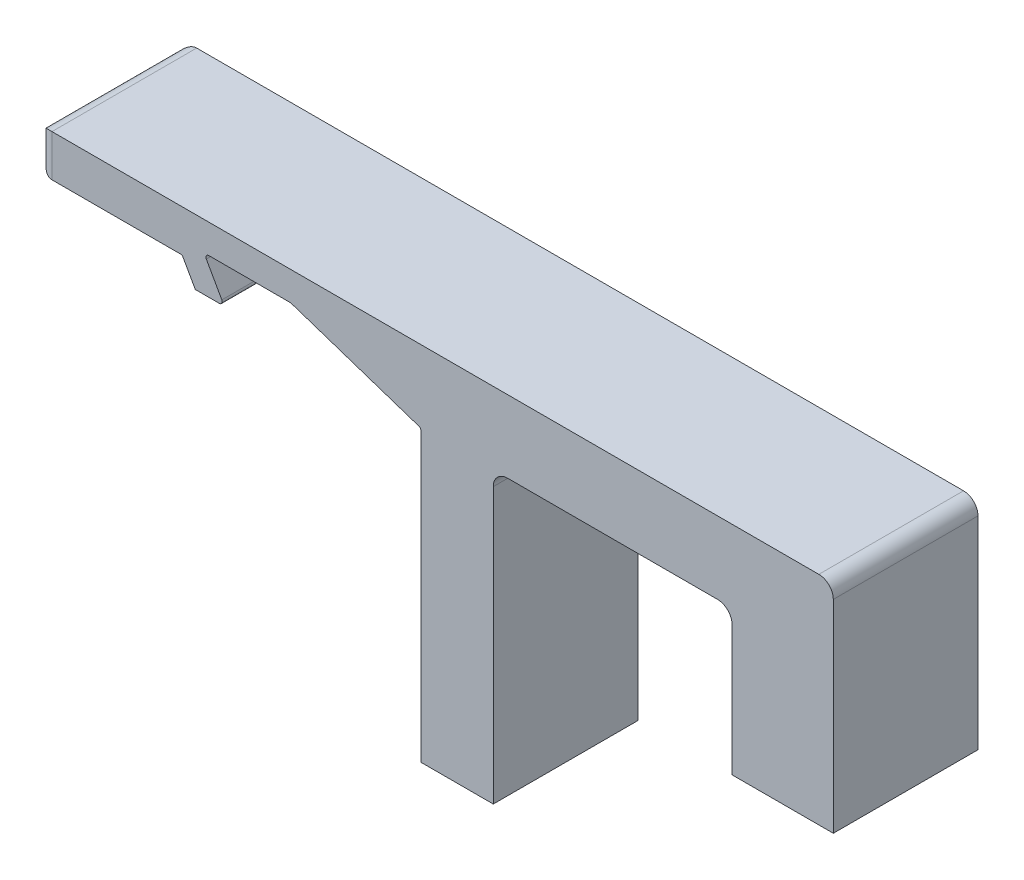
ISO-10303-21;
HEADER;
FILE_DESCRIPTION(('STEP AP214'),'2;1');
FILE_NAME('part.step','',(''),(''),'','','');
FILE_SCHEMA(('AUTOMOTIVE_DESIGN { 1 0 10303 214 1 1 1 1 }'));
ENDSEC;
DATA;
#1=APPLICATION_CONTEXT('core data for automotive mechanical design processes');
#2=APPLICATION_PROTOCOL_DEFINITION('international standard','automotive_design',2000,#1);
#3=PRODUCT_CONTEXT('',#1,'mechanical');
#4=PRODUCT('Part','Part','',(#3));
#5=PRODUCT_RELATED_PRODUCT_CATEGORY('part','',(#4));
#6=PRODUCT_DEFINITION_FORMATION('','',#4);
#7=PRODUCT_DEFINITION_CONTEXT('part definition',#1,'design');
#8=PRODUCT_DEFINITION('design','',#6,#7);
#9=PRODUCT_DEFINITION_SHAPE('','',#8);
#10=(LENGTH_UNIT() NAMED_UNIT(*) SI_UNIT(.MILLI.,.METRE.));
#11=(NAMED_UNIT(*) PLANE_ANGLE_UNIT() SI_UNIT($,.RADIAN.));
#12=(NAMED_UNIT(*) SI_UNIT($,.STERADIAN.) SOLID_ANGLE_UNIT());
#13=UNCERTAINTY_MEASURE_WITH_UNIT(LENGTH_MEASURE(1.E-05),#10,'distance_accuracy_value','');
#14=(GEOMETRIC_REPRESENTATION_CONTEXT(3) GLOBAL_UNCERTAINTY_ASSIGNED_CONTEXT((#13)) GLOBAL_UNIT_ASSIGNED_CONTEXT((#10,
#11,#12)) REPRESENTATION_CONTEXT('',''));
#15=CARTESIAN_POINT('',(0.,0.,0.));
#16=DIRECTION('',(0.,0.,1.));
#17=DIRECTION('',(1.,0.,0.));
#18=AXIS2_PLACEMENT_3D('',#15,#16,#17);
#19=CARTESIAN_POINT('',(0.,2.99999999999999,10.));
#20=DIRECTION('',(0.,1.,0.));
#21=DIRECTION('',(0.,0.,1.));
#22=AXIS2_PLACEMENT_3D('',#19,#20,#21);
#23=PLANE('',#22);
#24=DIRECTION('',(1.,0.,0.));
#25=VECTOR('',#24,1.);
#26=CARTESIAN_POINT('',(0.,2.99999999999999,0.));
#27=LINE('',#26,#25);
#28=CARTESIAN_POINT('',(-36.15795299471,2.99999999999999,0.));
#29=VERTEX_POINT('',#28);
#30=CARTESIAN_POINT('',(-30.5324555320337,2.99999999999999,0.));
#31=VERTEX_POINT('',#30);
#32=EDGE_CURVE('E288',#29,#31,#27,.T.);
#33=ORIENTED_EDGE('',*,*,#32,.T.);
#34=DIRECTION('',(0.,0.,-1.));
#35=VECTOR('',#34,1.);
#36=CARTESIAN_POINT('',(-30.5324555320337,2.99999999999999,10.));
#37=LINE('',#36,#35);
#38=CARTESIAN_POINT('',(-30.5324555320337,2.99999999999999,10.));
#39=VERTEX_POINT('',#38);
#40=EDGE_CURVE('E362',#31,#39,#37,.F.);
#41=ORIENTED_EDGE('',*,*,#40,.T.);
#42=DIRECTION('',(1.,0.,0.));
#43=VECTOR('',#42,1.);
#44=CARTESIAN_POINT('',(0.,2.99999999999999,10.));
#45=LINE('',#44,#43);
#46=CARTESIAN_POINT('',(-36.15795299471,2.99999999999999,10.));
#47=VERTEX_POINT('',#46);
#48=EDGE_CURVE('E336',#47,#39,#45,.T.);
#49=ORIENTED_EDGE('',*,*,#48,.F.);
#50=DIRECTION('',(0.,0.,-1.));
#51=VECTOR('',#50,1.);
#52=CARTESIAN_POINT('',(-36.15795299471,2.99999999999999,0.));
#53=LINE('',#52,#51);
#54=EDGE_CURVE('E358',#47,#29,#53,.T.);
#55=ORIENTED_EDGE('',*,*,#54,.T.);
#56=EDGE_LOOP('',(#33,#41,#49,#55));
#57=FACE_BOUND('',#56,.T.);
#58=ADVANCED_FACE('F47',(#57),#23,.F.);
#59=CARTESIAN_POINT('',(-2.15,-6.45000000000001,10.));
#60=DIRECTION('',(0.316227766016838,0.948683298050514,0.));
#61=DIRECTION('',(-0.948683298050514,0.316227766016838,0.));
#62=AXIS2_PLACEMENT_3D('',#59,#60,#61);
#63=PLANE('',#62);
#64=DIRECTION('',(0.948683298050514,-0.316227766016838,0.));
#65=VECTOR('',#64,1.);
#66=CARTESIAN_POINT('',(-2.15,-6.45000000000001,0.));
#67=LINE('',#66,#65);
#68=CARTESIAN_POINT('',(-30.4692099788303,2.9897366596101,0.));
#69=VERTEX_POINT('',#68);
#70=CARTESIAN_POINT('',(-21.6367544467966,0.0455848155988658,0.));
#71=VERTEX_POINT('',#70);
#72=EDGE_CURVE('E292',#69,#71,#67,.T.);
#73=ORIENTED_EDGE('',*,*,#72,.T.);
#74=DIRECTION('',(0.,0.,-1.));
#75=VECTOR('',#74,1.);
#76=CARTESIAN_POINT('',(-21.6367544467966,0.0455848155988666,10.));
#77=LINE('',#76,#75);
#78=CARTESIAN_POINT('',(-21.6367544467966,0.0455848155988658,10.));
#79=VERTEX_POINT('',#78);
#80=EDGE_CURVE('E355',#71,#79,#77,.F.);
#81=ORIENTED_EDGE('',*,*,#80,.T.);
#82=DIRECTION('',(0.948683298050514,-0.316227766016838,0.));
#83=VECTOR('',#82,1.);
#84=CARTESIAN_POINT('',(-2.15,-6.45000000000001,10.));
#85=LINE('',#84,#83);
#86=CARTESIAN_POINT('',(-30.4692099788303,2.9897366596101,10.));
#87=VERTEX_POINT('',#86);
#88=EDGE_CURVE('E242',#87,#79,#85,.T.);
#89=ORIENTED_EDGE('',*,*,#88,.F.);
#90=DIRECTION('',(0.,0.,-1.));
#91=VECTOR('',#90,1.);
#92=CARTESIAN_POINT('',(-30.4692099788303,2.98973665961009,0.));
#93=LINE('',#92,#91);
#94=EDGE_CURVE('E351',#87,#69,#93,.T.);
#95=ORIENTED_EDGE('',*,*,#94,.T.);
#96=EDGE_LOOP('',(#73,#81,#89,#95));
#97=FACE_BOUND('',#96,.T.);
#98=ADVANCED_FACE('F595',(#97),#63,.F.);
#99=CARTESIAN_POINT('',(-21.5,0.,10.));
#100=DIRECTION('',(-1.,0.,0.));
#101=DIRECTION('',(0.,0.,1.));
#102=AXIS2_PLACEMENT_3D('',#99,#100,#101);
#103=PLANE('',#102);
#104=DIRECTION('',(0.,1.,0.));
#105=VECTOR('',#104,1.);
#106=CARTESIAN_POINT('',(-21.5,0.,10.));
#107=LINE('',#106,#105);
#108=CARTESIAN_POINT('',(-21.5,-20.,10.));
#109=VERTEX_POINT('',#108);
#110=CARTESIAN_POINT('',(-21.5,-0.144151844011237,10.));
#111=VERTEX_POINT('',#110);
#112=EDGE_CURVE('E220',#109,#111,#107,.T.);
#113=ORIENTED_EDGE('',*,*,#112,.T.);
#114=DIRECTION('',(0.,0.,-1.));
#115=VECTOR('',#114,1.);
#116=CARTESIAN_POINT('',(-21.5,-0.144151844011237,10.));
#117=LINE('',#116,#115);
#118=CARTESIAN_POINT('',(-21.5,-0.144151844011237,0.));
#119=VERTEX_POINT('',#118);
#120=EDGE_CURVE('E229',#111,#119,#117,.T.);
#121=ORIENTED_EDGE('',*,*,#120,.T.);
#122=DIRECTION('',(0.,1.,0.));
#123=VECTOR('',#122,1.);
#124=CARTESIAN_POINT('',(-21.5,0.,0.));
#125=LINE('',#124,#123);
#126=CARTESIAN_POINT('',(-21.5,-20.,0.));
#127=VERTEX_POINT('',#126);
#128=EDGE_CURVE('E223',#127,#119,#125,.T.);
#129=ORIENTED_EDGE('',*,*,#128,.F.);
#130=DIRECTION('',(0.,0.,-1.));
#131=VECTOR('',#130,1.);
#132=CARTESIAN_POINT('',(-21.5,-20.,10.));
#133=LINE('',#132,#131);
#134=EDGE_CURVE('E216',#109,#127,#133,.T.);
#135=ORIENTED_EDGE('',*,*,#134,.F.);
#136=EDGE_LOOP('',(#113,#121,#129,#135));
#137=FACE_BOUND('',#136,.T.);
#138=ADVANCED_FACE('F218',(#137),#103,.T.);
#139=CARTESIAN_POINT('',(0.,-20.,10.));
#140=DIRECTION('',(0.,-1.,0.));
#141=DIRECTION('',(0.,0.,-1.));
#142=AXIS2_PLACEMENT_3D('',#139,#140,#141);
#143=PLANE('',#142);
#144=DIRECTION('',(-1.,0.,0.));
#145=VECTOR('',#144,1.);
#146=CARTESIAN_POINT('',(0.,-20.,0.));
#147=LINE('',#146,#145);
#148=CARTESIAN_POINT('',(-16.5,-20.,0.));
#149=VERTEX_POINT('',#148);
#150=EDGE_CURVE('E298',#149,#127,#147,.T.);
#151=ORIENTED_EDGE('',*,*,#150,.F.);
#152=DIRECTION('',(0.,0.,-1.));
#153=VECTOR('',#152,1.);
#154=CARTESIAN_POINT('',(-16.5,-20.,10.));
#155=LINE('',#154,#153);
#156=CARTESIAN_POINT('',(-16.5,-20.,10.));
#157=VERTEX_POINT('',#156);
#158=EDGE_CURVE('E230',#157,#149,#155,.T.);
#159=ORIENTED_EDGE('',*,*,#158,.F.);
#160=DIRECTION('',(-1.,0.,0.));
#161=VECTOR('',#160,1.);
#162=CARTESIAN_POINT('',(0.,-20.,10.));
#163=LINE('',#162,#161);
#164=EDGE_CURVE('E237',#157,#109,#163,.T.);
#165=ORIENTED_EDGE('',*,*,#164,.T.);
#166=ORIENTED_EDGE('',*,*,#134,.T.);
#167=EDGE_LOOP('',(#151,#159,#165,#166));
#168=FACE_BOUND('',#167,.T.);
#169=ADVANCED_FACE('F245',(#168),#143,.T.);
#170=CARTESIAN_POINT('',(-16.5,0.,10.));
#171=DIRECTION('',(1.,0.,0.));
#172=DIRECTION('',(0.,1.,0.));
#173=AXIS2_PLACEMENT_3D('',#170,#171,#172);
#174=PLANE('',#173);
#175=DIRECTION('',(0.,-1.,0.));
#176=VECTOR('',#175,1.);
#177=CARTESIAN_POINT('',(-16.5,0.,0.));
#178=LINE('',#177,#176);
#179=CARTESIAN_POINT('',(-16.5,-1.,0.));
#180=VERTEX_POINT('',#179);
#181=EDGE_CURVE('E301',#180,#149,#178,.T.);
#182=ORIENTED_EDGE('',*,*,#181,.F.);
#183=DIRECTION('',(0.,0.,-1.));
#184=VECTOR('',#183,1.);
#185=CARTESIAN_POINT('',(-16.5,-1.,10.));
#186=LINE('',#185,#184);
#187=CARTESIAN_POINT('',(-16.5,-1.,10.));
#188=VERTEX_POINT('',#187);
#189=EDGE_CURVE('E458',#180,#188,#186,.F.);
#190=ORIENTED_EDGE('',*,*,#189,.T.);
#191=DIRECTION('',(0.,-1.,0.));
#192=VECTOR('',#191,1.);
#193=CARTESIAN_POINT('',(-16.5,0.,10.));
#194=LINE('',#193,#192);
#195=EDGE_CURVE('E248',#188,#157,#194,.T.);
#196=ORIENTED_EDGE('',*,*,#195,.T.);
#197=ORIENTED_EDGE('',*,*,#158,.T.);
#198=EDGE_LOOP('',(#182,#190,#196,#197));
#199=FACE_BOUND('',#198,.T.);
#200=ADVANCED_FACE('F547',(#199),#174,.T.);
#201=CARTESIAN_POINT('',(0.,0.,10.));
#202=DIRECTION('',(0.,-1.,0.));
#203=DIRECTION('',(1.,0.,0.));
#204=AXIS2_PLACEMENT_3D('',#201,#202,#203);
#205=PLANE('',#204);
#206=DIRECTION('',(-1.,0.,0.));
#207=VECTOR('',#206,1.);
#208=CARTESIAN_POINT('',(0.,0.,10.));
#209=LINE('',#208,#207);
#210=CARTESIAN_POINT('',(-1.,0.,10.));
#211=VERTEX_POINT('',#210);
#212=CARTESIAN_POINT('',(-15.5,0.,10.));
#213=VERTEX_POINT('',#212);
#214=EDGE_CURVE('E251',#211,#213,#209,.T.);
#215=ORIENTED_EDGE('',*,*,#214,.T.);
#216=DIRECTION('',(0.,0.,-1.));
#217=VECTOR('',#216,1.);
#218=CARTESIAN_POINT('',(-15.5,0.,0.));
#219=LINE('',#218,#217);
#220=CARTESIAN_POINT('',(-15.5,0.,0.));
#221=VERTEX_POINT('',#220);
#222=EDGE_CURVE('E455',#213,#221,#219,.T.);
#223=ORIENTED_EDGE('',*,*,#222,.T.);
#224=DIRECTION('',(-1.,0.,0.));
#225=VECTOR('',#224,1.);
#226=CARTESIAN_POINT('',(0.,0.,0.));
#227=LINE('',#226,#225);
#228=CARTESIAN_POINT('',(-1.,0.,0.));
#229=VERTEX_POINT('',#228);
#230=EDGE_CURVE('E304',#229,#221,#227,.T.);
#231=ORIENTED_EDGE('',*,*,#230,.F.);
#232=DIRECTION('',(0.,0.,-1.));
#233=VECTOR('',#232,1.);
#234=CARTESIAN_POINT('',(-1.,0.,10.));
#235=LINE('',#234,#233);
#236=EDGE_CURVE('E452',#229,#211,#235,.F.);
#237=ORIENTED_EDGE('',*,*,#236,.T.);
#238=EDGE_LOOP('',(#215,#223,#231,#237));
#239=FACE_BOUND('',#238,.T.);
#240=ADVANCED_FACE('F553',(#239),#205,.T.);
#241=CARTESIAN_POINT('',(0.,0.,10.));
#242=DIRECTION('',(-1.,0.,0.));
#243=DIRECTION('',(0.,-1.,0.));
#244=AXIS2_PLACEMENT_3D('',#241,#242,#243);
#245=PLANE('',#244);
#246=DIRECTION('',(0.,1.,0.));
#247=VECTOR('',#246,1.);
#248=CARTESIAN_POINT('',(0.,0.,10.));
#249=LINE('',#248,#247);
#250=CARTESIAN_POINT('',(0.,-10.,10.));
#251=VERTEX_POINT('',#250);
#252=CARTESIAN_POINT('',(0.,-1.,10.));
#253=VERTEX_POINT('',#252);
#254=EDGE_CURVE('E258',#251,#253,#249,.T.);
#255=ORIENTED_EDGE('',*,*,#254,.T.);
#256=DIRECTION('',(0.,0.,-1.));
#257=VECTOR('',#256,1.);
#258=CARTESIAN_POINT('',(0.,-1.,0.));
#259=LINE('',#258,#257);
#260=CARTESIAN_POINT('',(0.,-1.,0.));
#261=VERTEX_POINT('',#260);
#262=EDGE_CURVE('E461',#253,#261,#259,.T.);
#263=ORIENTED_EDGE('',*,*,#262,.T.);
#264=DIRECTION('',(0.,1.,0.));
#265=VECTOR('',#264,1.);
#266=CARTESIAN_POINT('',(0.,0.,0.));
#267=LINE('',#266,#265);
#268=CARTESIAN_POINT('',(0.,-10.,0.));
#269=VERTEX_POINT('',#268);
#270=EDGE_CURVE('E307',#269,#261,#267,.T.);
#271=ORIENTED_EDGE('',*,*,#270,.F.);
#272=DIRECTION('',(0.,0.,-1.));
#273=VECTOR('',#272,1.);
#274=CARTESIAN_POINT('',(0.,-10.,10.));
#275=LINE('',#274,#273);
#276=EDGE_CURVE('E344',#251,#269,#275,.T.);
#277=ORIENTED_EDGE('',*,*,#276,.F.);
#278=EDGE_LOOP('',(#255,#263,#271,#277));
#279=FACE_BOUND('',#278,.T.);
#280=ADVANCED_FACE('F560',(#279),#245,.T.);
#281=CARTESIAN_POINT('',(0.,-10.,10.));
#282=DIRECTION('',(0.,-1.,0.));
#283=DIRECTION('',(0.,0.,-1.));
#284=AXIS2_PLACEMENT_3D('',#281,#282,#283);
#285=PLANE('',#284);
#286=DIRECTION('',(-1.,0.,0.));
#287=VECTOR('',#286,1.);
#288=CARTESIAN_POINT('',(0.,-10.,0.));
#289=LINE('',#288,#287);
#290=CARTESIAN_POINT('',(7.,-10.,0.));
#291=VERTEX_POINT('',#290);
#292=EDGE_CURVE('E311',#291,#269,#289,.T.);
#293=ORIENTED_EDGE('',*,*,#292,.F.);
#294=DIRECTION('',(0.,0.,-1.));
#295=VECTOR('',#294,1.);
#296=CARTESIAN_POINT('',(7.,-10.,10.));
#297=LINE('',#296,#295);
#298=CARTESIAN_POINT('',(7.,-10.,10.));
#299=VERTEX_POINT('',#298);
#300=EDGE_CURVE('E340',#299,#291,#297,.T.);
#301=ORIENTED_EDGE('',*,*,#300,.F.);
#302=DIRECTION('',(-1.,0.,0.));
#303=VECTOR('',#302,1.);
#304=CARTESIAN_POINT('',(0.,-10.,10.));
#305=LINE('',#304,#303);
#306=EDGE_CURVE('E262',#299,#251,#305,.T.);
#307=ORIENTED_EDGE('',*,*,#306,.T.);
#308=ORIENTED_EDGE('',*,*,#276,.T.);
#309=EDGE_LOOP('',(#293,#301,#307,#308));
#310=FACE_BOUND('',#309,.T.);
#311=ADVANCED_FACE('F567',(#310),#285,.T.);
#312=CARTESIAN_POINT('',(7.,0.,10.));
#313=DIRECTION('',(1.,0.,0.));
#314=DIRECTION('',(0.,1.,0.));
#315=AXIS2_PLACEMENT_3D('',#312,#313,#314);
#316=PLANE('',#315);
#317=DIRECTION('',(0.,-1.,0.));
#318=VECTOR('',#317,1.);
#319=CARTESIAN_POINT('',(7.,0.,0.));
#320=LINE('',#319,#318);
#321=CARTESIAN_POINT('',(6.99999999999999,4.,0.));
#322=VERTEX_POINT('',#321);
#323=EDGE_CURVE('E315',#322,#291,#320,.T.);
#324=ORIENTED_EDGE('',*,*,#323,.F.);
#325=DIRECTION('',(0.,0.,-1.));
#326=VECTOR('',#325,1.);
#327=CARTESIAN_POINT('',(6.99999999999999,4.,10.));
#328=LINE('',#327,#326);
#329=CARTESIAN_POINT('',(6.99999999999999,4.,10.));
#330=VERTEX_POINT('',#329);
#331=EDGE_CURVE('E449',#322,#330,#328,.F.);
#332=ORIENTED_EDGE('',*,*,#331,.T.);
#333=DIRECTION('',(0.,-1.,0.));
#334=VECTOR('',#333,1.);
#335=CARTESIAN_POINT('',(7.,0.,10.));
#336=LINE('',#335,#334);
#337=EDGE_CURVE('E266',#330,#299,#336,.T.);
#338=ORIENTED_EDGE('',*,*,#337,.T.);
#339=ORIENTED_EDGE('',*,*,#300,.T.);
#340=EDGE_LOOP('',(#324,#332,#338,#339));
#341=FACE_BOUND('',#340,.T.);
#342=ADVANCED_FACE('F570',(#341),#316,.T.);
#343=CARTESIAN_POINT('',(0.,5.,10.));
#344=DIRECTION('',(0.,1.,0.));
#345=DIRECTION('',(0.,0.,1.));
#346=AXIS2_PLACEMENT_3D('',#343,#344,#345);
#347=PLANE('',#346);
#348=DIRECTION('',(1.,0.,0.));
#349=VECTOR('',#348,1.);
#350=CARTESIAN_POINT('',(0.,5.,0.));
#351=LINE('',#350,#349);
#352=CARTESIAN_POINT('',(-47.,5.,0.));
#353=VERTEX_POINT('',#352);
#354=CARTESIAN_POINT('',(5.99999999999999,5.,0.));
#355=VERTEX_POINT('',#354);
#356=EDGE_CURVE('E318',#353,#355,#351,.T.);
#357=ORIENTED_EDGE('',*,*,#356,.F.);
#358=DIRECTION('',(0.,0.,-1.));
#359=VECTOR('',#358,1.);
#360=CARTESIAN_POINT('',(-47.,5.,10.));
#361=LINE('',#360,#359);
#362=CARTESIAN_POINT('',(-47.,5.,10.));
#363=VERTEX_POINT('',#362);
#364=EDGE_CURVE('E430',#353,#363,#361,.F.);
#365=ORIENTED_EDGE('',*,*,#364,.T.);
#366=DIRECTION('',(1.,0.,0.));
#367=VECTOR('',#366,1.);
#368=CARTESIAN_POINT('',(0.,5.,10.));
#369=LINE('',#368,#367);
#370=CARTESIAN_POINT('',(5.99999999999999,5.,10.));
#371=VERTEX_POINT('',#370);
#372=EDGE_CURVE('E269',#363,#371,#369,.T.);
#373=ORIENTED_EDGE('',*,*,#372,.T.);
#374=DIRECTION('',(0.,0.,-1.));
#375=VECTOR('',#374,1.);
#376=CARTESIAN_POINT('',(5.99999999999999,5.,10.));
#377=LINE('',#376,#375);
#378=EDGE_CURVE('E426',#371,#355,#377,.T.);
#379=ORIENTED_EDGE('',*,*,#378,.T.);
#380=EDGE_LOOP('',(#357,#365,#373,#379));
#381=FACE_BOUND('',#380,.T.);
#382=ADVANCED_FACE('F577',(#381),#347,.T.);
#383=CARTESIAN_POINT('',(-48.,0.,10.));
#384=DIRECTION('',(-1.,0.,0.));
#385=DIRECTION('',(0.,0.,1.));
#386=AXIS2_PLACEMENT_3D('',#383,#384,#385);
#387=PLANE('',#386);
#388=DIRECTION('',(0.,1.,0.));
#389=VECTOR('',#388,1.);
#390=CARTESIAN_POINT('',(-48.,0.,9.));
#391=LINE('',#390,#389);
#392=CARTESIAN_POINT('',(-48.,3.11152184028619,9.));
#393=VERTEX_POINT('',#392);
#394=CARTESIAN_POINT('',(-48.,4.,9.));
#395=VERTEX_POINT('',#394);
#396=EDGE_CURVE('E419',#393,#395,#391,.T.);
#397=ORIENTED_EDGE('',*,*,#396,.T.);
#398=DIRECTION('',(0.,0.,-1.));
#399=VECTOR('',#398,1.);
#400=CARTESIAN_POINT('',(-48.,4.,10.));
#401=LINE('',#400,#399);
#402=CARTESIAN_POINT('',(-48.,4.,1.));
#403=VERTEX_POINT('',#402);
#404=EDGE_CURVE('E422',#395,#403,#401,.T.);
#405=ORIENTED_EDGE('',*,*,#404,.T.);
#406=DIRECTION('',(0.,1.,0.));
#407=VECTOR('',#406,1.);
#408=CARTESIAN_POINT('',(-48.,2.11152184028619,1.));
#409=LINE('',#408,#407);
#410=CARTESIAN_POINT('',(-48.,3.11152184028619,1.));
#411=VERTEX_POINT('',#410);
#412=EDGE_CURVE('E413',#403,#411,#409,.F.);
#413=ORIENTED_EDGE('',*,*,#412,.T.);
#414=DIRECTION('',(0.,0.,-1.));
#415=VECTOR('',#414,1.);
#416=CARTESIAN_POINT('',(-48.,3.11152184028619,10.));
#417=LINE('',#416,#415);
#418=EDGE_CURVE('E416',#411,#393,#417,.F.);
#419=ORIENTED_EDGE('',*,*,#418,.T.);
#420=EDGE_LOOP('',(#397,#405,#413,#419));
#421=FACE_BOUND('',#420,.T.);
#422=ADVANCED_FACE('F585',(#421),#387,.T.);
#423=CARTESIAN_POINT('',(0.,2.11152184028619,10.));
#424=DIRECTION('',(0.,1.,0.));
#425=DIRECTION('',(-1.,0.,0.));
#426=AXIS2_PLACEMENT_3D('',#423,#424,#425);
#427=PLANE('',#426);
#428=DIRECTION('',(1.,0.,0.));
#429=VECTOR('',#428,1.);
#430=CARTESIAN_POINT('',(0.,2.11152184028619,10.));
#431=LINE('',#430,#429);
#432=CARTESIAN_POINT('',(-47.,2.11152184028619,10.));
#433=VERTEX_POINT('',#432);
#434=CARTESIAN_POINT('',(-38.1169429914058,2.11152184028619,10.));
#435=VERTEX_POINT('',#434);
#436=EDGE_CURVE('E273',#433,#435,#431,.T.);
#437=ORIENTED_EDGE('',*,*,#436,.F.);
#438=DIRECTION('',(0.,0.,-1.));
#439=VECTOR('',#438,1.);
#440=CARTESIAN_POINT('',(-47.,2.11152184028619,0.));
#441=LINE('',#440,#439);
#442=CARTESIAN_POINT('',(-47.,2.11152184028619,0.));
#443=VERTEX_POINT('',#442);
#444=EDGE_CURVE('E440',#433,#443,#441,.T.);
#445=ORIENTED_EDGE('',*,*,#444,.T.);
#446=DIRECTION('',(1.,0.,0.));
#447=VECTOR('',#446,1.);
#448=CARTESIAN_POINT('',(0.,2.11152184028619,0.));
#449=LINE('',#448,#447);
#450=CARTESIAN_POINT('',(-38.1169429914058,2.11152184028619,0.));
#451=VERTEX_POINT('',#450);
#452=EDGE_CURVE('E322',#443,#451,#449,.T.);
#453=ORIENTED_EDGE('',*,*,#452,.T.);
#454=DIRECTION('',(0.,0.,-1.));
#455=VECTOR('',#454,1.);
#456=CARTESIAN_POINT('',(-38.1169429914058,2.11152184028619,10.));
#457=LINE('',#456,#455);
#458=EDGE_CURVE('E369',#451,#435,#457,.F.);
#459=ORIENTED_EDGE('',*,*,#458,.T.);
#460=EDGE_LOOP('',(#437,#445,#453,#459));
#461=FACE_BOUND('',#460,.T.);
#462=ADVANCED_FACE('F499',(#461),#427,.F.);
#463=CARTESIAN_POINT('',(-27.9575847654668,-15.7334113730338,10.));
#464=DIRECTION('',(0.871478687726494,0.490433376554358,0.));
#465=DIRECTION('',(-0.490433376554358,0.871478687726494,0.));
#466=AXIS2_PLACEMENT_3D('',#463,#464,#465);
#467=PLANE('',#466);
#468=DIRECTION('',(0.490433376554358,-0.871478687726494,0.));
#469=VECTOR('',#468,1.);
#470=CARTESIAN_POINT('',(-27.9575847654668,-15.7334113730338,10.));
#471=LINE('',#470,#469);
#472=CARTESIAN_POINT('',(-37.9426472538605,2.00960851559706,10.));
#473=VERTEX_POINT('',#472);
#474=CARTESIAN_POINT('',(-37.0930999132239,0.499999999999997,10.));
#475=VERTEX_POINT('',#474);
#476=EDGE_CURVE('E276',#473,#475,#471,.T.);
#477=ORIENTED_EDGE('',*,*,#476,.F.);
#478=DIRECTION('',(0.,0.,-1.));
#479=VECTOR('',#478,1.);
#480=CARTESIAN_POINT('',(-37.9426472538605,2.00960851559706,0.));
#481=LINE('',#480,#479);
#482=CARTESIAN_POINT('',(-37.9426472538605,2.00960851559706,0.));
#483=VERTEX_POINT('',#482);
#484=EDGE_CURVE('E365',#473,#483,#481,.T.);
#485=ORIENTED_EDGE('',*,*,#484,.T.);
#486=DIRECTION('',(0.490433376554358,-0.871478687726494,0.));
#487=VECTOR('',#486,1.);
#488=CARTESIAN_POINT('',(-27.9575847654668,-15.7334113730338,0.));
#489=LINE('',#488,#487);
#490=CARTESIAN_POINT('',(-37.0930999132239,0.499999999999997,0.));
#491=VERTEX_POINT('',#490);
#492=EDGE_CURVE('E325',#483,#491,#489,.T.);
#493=ORIENTED_EDGE('',*,*,#492,.T.);
#494=DIRECTION('',(0.,0.,-1.));
#495=VECTOR('',#494,1.);
#496=CARTESIAN_POINT('',(-37.0930999132239,0.499999999999997,10.));
#497=LINE('',#496,#495);
#498=EDGE_CURVE('E287',#475,#491,#497,.T.);
#499=ORIENTED_EDGE('',*,*,#498,.F.);
#500=EDGE_LOOP('',(#477,#485,#493,#499));
#501=FACE_BOUND('',#500,.T.);
#502=ADVANCED_FACE('F512',(#501),#467,.F.);
#503=CARTESIAN_POINT('',(0.,0.499999999999994,10.));
#504=DIRECTION('',(0.,1.,0.));
#505=DIRECTION('',(0.,0.,1.));
#506=AXIS2_PLACEMENT_3D('',#503,#504,#505);
#507=PLANE('',#506);
#508=DIRECTION('',(1.,0.,0.));
#509=VECTOR('',#508,1.);
#510=CARTESIAN_POINT('',(0.,0.499999999999994,0.));
#511=LINE('',#510,#509);
#512=CARTESIAN_POINT('',(-35.4351469185139,0.499999999999994,0.));
#513=VERTEX_POINT('',#512);
#514=EDGE_CURVE('E328',#491,#513,#511,.T.);
#515=ORIENTED_EDGE('',*,*,#514,.T.);
#516=DIRECTION('',(0.,0.,-1.));
#517=VECTOR('',#516,1.);
#518=CARTESIAN_POINT('',(-35.4351469185139,0.499999999999994,10.));
#519=LINE('',#518,#517);
#520=CARTESIAN_POINT('',(-35.4351469185139,0.499999999999994,10.));
#521=VERTEX_POINT('',#520);
#522=EDGE_CURVE('E383',#513,#521,#519,.F.);
#523=ORIENTED_EDGE('',*,*,#522,.T.);
#524=DIRECTION('',(1.,0.,0.));
#525=VECTOR('',#524,1.);
#526=CARTESIAN_POINT('',(0.,0.499999999999994,10.));
#527=LINE('',#526,#525);
#528=EDGE_CURVE('E279',#475,#521,#527,.T.);
#529=ORIENTED_EDGE('',*,*,#528,.F.);
#530=ORIENTED_EDGE('',*,*,#498,.T.);
#531=EDGE_LOOP('',(#515,#523,#529,#530));
#532=FACE_BOUND('',#531,.T.);
#533=ADVANCED_FACE('F515',(#532),#507,.F.);
#534=CARTESIAN_POINT('',(-26.4386345591438,-14.8786069022,10.));
#535=DIRECTION('',(-0.871478687726494,-0.490433376554358,0.));
#536=DIRECTION('',(0.490433376554358,-0.871478687726494,0.));
#537=AXIS2_PLACEMENT_3D('',#534,#535,#536);
#538=PLANE('',#537);
#539=DIRECTION('',(-0.490433376554358,0.871478687726494,0.));
#540=VECTOR('',#539,1.);
#541=CARTESIAN_POINT('',(-26.4386345591438,-14.8786069022,10.));
#542=LINE('',#541,#540);
#543=CARTESIAN_POINT('',(-35.2608511809686,0.798086675310868,10.));
#544=VERTEX_POINT('',#543);
#545=CARTESIAN_POINT('',(-36.3322487322553,2.70191332468912,10.));
#546=VERTEX_POINT('',#545);
#547=EDGE_CURVE('E283',#544,#546,#542,.T.);
#548=ORIENTED_EDGE('',*,*,#547,.F.);
#549=DIRECTION('',(0.,0.,-1.));
#550=VECTOR('',#549,1.);
#551=CARTESIAN_POINT('',(-35.2608511809686,0.798086675310864,10.));
#552=LINE('',#551,#550);
#553=CARTESIAN_POINT('',(-35.2608511809686,0.798086675310868,0.));
#554=VERTEX_POINT('',#553);
#555=EDGE_CURVE('E376',#544,#554,#552,.T.);
#556=ORIENTED_EDGE('',*,*,#555,.T.);
#557=DIRECTION('',(-0.490433376554358,0.871478687726494,0.));
#558=VECTOR('',#557,1.);
#559=CARTESIAN_POINT('',(-26.4386345591438,-14.8786069022,0.));
#560=LINE('',#559,#558);
#561=CARTESIAN_POINT('',(-36.3322487322553,2.70191332468912,0.));
#562=VERTEX_POINT('',#561);
#563=EDGE_CURVE('E332',#554,#562,#560,.T.);
#564=ORIENTED_EDGE('',*,*,#563,.T.);
#565=DIRECTION('',(0.,0.,-1.));
#566=VECTOR('',#565,1.);
#567=CARTESIAN_POINT('',(-36.3322487322553,2.70191332468912,10.));
#568=LINE('',#567,#566);
#569=EDGE_CURVE('E373',#562,#546,#568,.F.);
#570=ORIENTED_EDGE('',*,*,#569,.T.);
#571=EDGE_LOOP('',(#548,#556,#564,#570));
#572=FACE_BOUND('',#571,.T.);
#573=ADVANCED_FACE('F524',(#572),#538,.F.);
#574=CARTESIAN_POINT('',(0.,0.,10.));
#575=DIRECTION('',(0.,0.,1.));
#576=DIRECTION('',(1.,0.,0.));
#577=AXIS2_PLACEMENT_3D('',#574,#575,#576);
#578=PLANE('',#577);
#579=ORIENTED_EDGE('',*,*,#372,.F.);
#580=DIRECTION('',(0.,1.,0.));
#581=VECTOR('',#580,1.);
#582=CARTESIAN_POINT('',(-47.,0.,10.));
#583=LINE('',#582,#581);
#584=EDGE_CURVE('E437',#363,#433,#583,.F.);
#585=ORIENTED_EDGE('',*,*,#584,.T.);
#586=ORIENTED_EDGE('',*,*,#436,.T.);
#587=CARTESIAN_POINT('',(-38.1169429914058,1.91152184028619,10.));
#588=DIRECTION('',(0.,0.,1.));
#589=DIRECTION('',(1.,0.,0.));
#590=AXIS2_PLACEMENT_3D('',#587,#588,#589);
#591=CIRCLE('',#590,0.2);
#592=EDGE_CURVE('E404',#435,#473,#591,.F.);
#593=ORIENTED_EDGE('',*,*,#592,.T.);
#594=ORIENTED_EDGE('',*,*,#476,.T.);
#595=ORIENTED_EDGE('',*,*,#528,.T.);
#596=CARTESIAN_POINT('',(-35.4351469185139,0.699999999999996,10.));
#597=DIRECTION('',(0.,0.,1.));
#598=DIRECTION('',(1.,0.,0.));
#599=AXIS2_PLACEMENT_3D('',#596,#597,#598);
#600=CIRCLE('',#599,0.2);
#601=EDGE_CURVE('E386',#521,#544,#600,.T.);
#602=ORIENTED_EDGE('',*,*,#601,.T.);
#603=ORIENTED_EDGE('',*,*,#547,.T.);
#604=CARTESIAN_POINT('',(-36.15795299471,2.79999999999999,10.));
#605=DIRECTION('',(0.,0.,1.));
#606=DIRECTION('',(1.,0.,0.));
#607=AXIS2_PLACEMENT_3D('',#604,#605,#606);
#608=CIRCLE('',#607,0.2);
#609=EDGE_CURVE('E410',#546,#47,#608,.F.);
#610=ORIENTED_EDGE('',*,*,#609,.T.);
#611=ORIENTED_EDGE('',*,*,#48,.T.);
#612=CARTESIAN_POINT('',(-30.5324555320337,2.79999999999999,10.));
#613=DIRECTION('',(0.,0.,1.));
#614=DIRECTION('',(1.,0.,0.));
#615=AXIS2_PLACEMENT_3D('',#612,#613,#614);
#616=CIRCLE('',#615,0.2);
#617=EDGE_CURVE('E397',#39,#87,#616,.F.);
#618=ORIENTED_EDGE('',*,*,#617,.T.);
#619=ORIENTED_EDGE('',*,*,#88,.T.);
#620=CARTESIAN_POINT('',(-21.7,-0.144151844011237,10.));
#621=DIRECTION('',(0.,0.,1.));
#622=DIRECTION('',(1.,0.,0.));
#623=AXIS2_PLACEMENT_3D('',#620,#621,#622);
#624=CIRCLE('',#623,0.2);
#625=EDGE_CURVE('E240',#79,#111,#624,.F.);
#626=ORIENTED_EDGE('',*,*,#625,.T.);
#627=ORIENTED_EDGE('',*,*,#112,.F.);
#628=ORIENTED_EDGE('',*,*,#164,.F.);
#629=ORIENTED_EDGE('',*,*,#195,.F.);
#630=CARTESIAN_POINT('',(-15.5,-1.,10.));
#631=DIRECTION('',(0.,0.,1.));
#632=DIRECTION('',(1.,0.,0.));
#633=AXIS2_PLACEMENT_3D('',#630,#631,#632);
#634=CIRCLE('',#633,1.);
#635=EDGE_CURVE('E467',#188,#213,#634,.F.);
#636=ORIENTED_EDGE('',*,*,#635,.T.);
#637=ORIENTED_EDGE('',*,*,#214,.F.);
#638=CARTESIAN_POINT('',(-1.,-1.,10.));
#639=DIRECTION('',(0.,0.,1.));
#640=DIRECTION('',(1.,0.,0.));
#641=AXIS2_PLACEMENT_3D('',#638,#639,#640);
#642=CIRCLE('',#641,1.);
#643=EDGE_CURVE('E11',#211,#253,#642,.F.);
#644=ORIENTED_EDGE('',*,*,#643,.T.);
#645=ORIENTED_EDGE('',*,*,#254,.F.);
#646=ORIENTED_EDGE('',*,*,#306,.F.);
#647=ORIENTED_EDGE('',*,*,#337,.F.);
#648=CARTESIAN_POINT('',(5.99999999999999,4.,10.));
#649=DIRECTION('',(0.,0.,1.));
#650=DIRECTION('',(1.,0.,0.));
#651=AXIS2_PLACEMENT_3D('',#648,#649,#650);
#652=CIRCLE('',#651,1.);
#653=EDGE_CURVE('E434',#330,#371,#652,.T.);
#654=ORIENTED_EDGE('',*,*,#653,.T.);
#655=EDGE_LOOP('',(#579,#585,#586,#593,#594,#595,#602,#603,#610,#611,#618,#619,#626,#627,#628,
#629,#636,#637,#644,#645,#646,#647,#654));
#656=FACE_BOUND('',#655,.T.);
#657=ADVANCED_FACE('F235',(#656),#578,.T.);
#658=CARTESIAN_POINT('',(0.,0.,0.));
#659=DIRECTION('',(0.,0.,1.));
#660=DIRECTION('',(1.,0.,0.));
#661=AXIS2_PLACEMENT_3D('',#658,#659,#660);
#662=PLANE('',#661);
#663=ORIENTED_EDGE('',*,*,#452,.F.);
#664=DIRECTION('',(0.,1.,0.));
#665=VECTOR('',#664,1.);
#666=CARTESIAN_POINT('',(-47.,5.,0.));
#667=LINE('',#666,#665);
#668=EDGE_CURVE('E446',#443,#353,#667,.T.);
#669=ORIENTED_EDGE('',*,*,#668,.T.);
#670=ORIENTED_EDGE('',*,*,#356,.T.);
#671=CARTESIAN_POINT('',(5.99999999999999,4.,0.));
#672=DIRECTION('',(0.,0.,1.));
#673=DIRECTION('',(1.,0.,0.));
#674=AXIS2_PLACEMENT_3D('',#671,#672,#673);
#675=CIRCLE('',#674,1.);
#676=EDGE_CURVE('E443',#355,#322,#675,.F.);
#677=ORIENTED_EDGE('',*,*,#676,.T.);
#678=ORIENTED_EDGE('',*,*,#323,.T.);
#679=ORIENTED_EDGE('',*,*,#292,.T.);
#680=ORIENTED_EDGE('',*,*,#270,.T.);
#681=CARTESIAN_POINT('',(-1.,-1.,0.));
#682=DIRECTION('',(0.,0.,1.));
#683=DIRECTION('',(1.,0.,0.));
#684=AXIS2_PLACEMENT_3D('',#681,#682,#683);
#685=CIRCLE('',#684,1.);
#686=EDGE_CURVE('E57',#261,#229,#685,.T.);
#687=ORIENTED_EDGE('',*,*,#686,.T.);
#688=ORIENTED_EDGE('',*,*,#230,.T.);
#689=CARTESIAN_POINT('',(-15.5,-1.,0.));
#690=DIRECTION('',(0.,0.,1.));
#691=DIRECTION('',(1.,0.,0.));
#692=AXIS2_PLACEMENT_3D('',#689,#690,#691);
#693=CIRCLE('',#692,1.);
#694=EDGE_CURVE('E65',#221,#180,#693,.T.);
#695=ORIENTED_EDGE('',*,*,#694,.T.);
#696=ORIENTED_EDGE('',*,*,#181,.T.);
#697=ORIENTED_EDGE('',*,*,#150,.T.);
#698=ORIENTED_EDGE('',*,*,#128,.T.);
#699=CARTESIAN_POINT('',(-21.7,-0.144151844011237,0.));
#700=DIRECTION('',(0.,0.,1.));
#701=DIRECTION('',(1.,0.,0.));
#702=AXIS2_PLACEMENT_3D('',#699,#700,#701);
#703=CIRCLE('',#702,0.2);
#704=EDGE_CURVE('E389',#119,#71,#703,.T.);
#705=ORIENTED_EDGE('',*,*,#704,.T.);
#706=ORIENTED_EDGE('',*,*,#72,.F.);
#707=CARTESIAN_POINT('',(-30.5324555320337,2.79999999999999,0.));
#708=DIRECTION('',(0.,0.,1.));
#709=DIRECTION('',(1.,0.,0.));
#710=AXIS2_PLACEMENT_3D('',#707,#708,#709);
#711=CIRCLE('',#710,0.2);
#712=EDGE_CURVE('E394',#69,#31,#711,.T.);
#713=ORIENTED_EDGE('',*,*,#712,.T.);
#714=ORIENTED_EDGE('',*,*,#32,.F.);
#715=CARTESIAN_POINT('',(-36.15795299471,2.79999999999999,0.));
#716=DIRECTION('',(0.,0.,1.));
#717=DIRECTION('',(1.,0.,0.));
#718=AXIS2_PLACEMENT_3D('',#715,#716,#717);
#719=CIRCLE('',#718,0.2);
#720=EDGE_CURVE('E407',#29,#562,#719,.T.);
#721=ORIENTED_EDGE('',*,*,#720,.T.);
#722=ORIENTED_EDGE('',*,*,#563,.F.);
#723=CARTESIAN_POINT('',(-35.4351469185139,0.699999999999996,0.));
#724=DIRECTION('',(0.,0.,1.));
#725=DIRECTION('',(1.,0.,0.));
#726=AXIS2_PLACEMENT_3D('',#723,#724,#725);
#727=CIRCLE('',#726,0.2);
#728=EDGE_CURVE('E380',#554,#513,#727,.F.);
#729=ORIENTED_EDGE('',*,*,#728,.T.);
#730=ORIENTED_EDGE('',*,*,#514,.F.);
#731=ORIENTED_EDGE('',*,*,#492,.F.);
#732=CARTESIAN_POINT('',(-38.1169429914058,1.91152184028619,0.));
#733=DIRECTION('',(0.,0.,1.));
#734=DIRECTION('',(1.,0.,0.));
#735=AXIS2_PLACEMENT_3D('',#732,#733,#734);
#736=CIRCLE('',#735,0.2);
#737=EDGE_CURVE('E400',#483,#451,#736,.T.);
#738=ORIENTED_EDGE('',*,*,#737,.T.);
#739=EDGE_LOOP('',(#663,#669,#670,#677,#678,#679,#680,#687,#688,#695,#696,#697,#698,#705,#706,
#713,#714,#721,#722,#729,#730,#731,#738));
#740=FACE_BOUND('',#739,.T.);
#741=ADVANCED_FACE('F500',(#740),#662,.F.);
#742=CARTESIAN_POINT('',(-21.7,-0.144151844011237,10.));
#743=DIRECTION('',(0.,0.,-1.));
#744=DIRECTION('',(-1.,0.,0.));
#745=AXIS2_PLACEMENT_3D('',#742,#743,#744);
#746=CYLINDRICAL_SURFACE('',#745,0.2);
#747=ORIENTED_EDGE('',*,*,#625,.F.);
#748=ORIENTED_EDGE('',*,*,#80,.F.);
#749=ORIENTED_EDGE('',*,*,#704,.F.);
#750=ORIENTED_EDGE('',*,*,#120,.F.);
#751=EDGE_LOOP('',(#747,#748,#749,#750));
#752=FACE_BOUND('',#751,.T.);
#753=ADVANCED_FACE('F544',(#752),#746,.F.);
#754=CARTESIAN_POINT('',(-30.5324555320337,2.79999999999999,10.));
#755=DIRECTION('',(0.,0.,1.));
#756=DIRECTION('',(1.,0.,0.));
#757=AXIS2_PLACEMENT_3D('',#754,#755,#756);
#758=CYLINDRICAL_SURFACE('',#757,0.2);
#759=ORIENTED_EDGE('',*,*,#617,.F.);
#760=ORIENTED_EDGE('',*,*,#40,.F.);
#761=ORIENTED_EDGE('',*,*,#712,.F.);
#762=ORIENTED_EDGE('',*,*,#94,.F.);
#763=EDGE_LOOP('',(#759,#760,#761,#762));
#764=FACE_BOUND('',#763,.T.);
#765=ADVANCED_FACE('F606',(#764),#758,.F.);
#766=CARTESIAN_POINT('',(-38.1169429914058,1.91152184028619,10.));
#767=DIRECTION('',(0.,0.,1.));
#768=DIRECTION('',(1.,0.,0.));
#769=AXIS2_PLACEMENT_3D('',#766,#767,#768);
#770=CYLINDRICAL_SURFACE('',#769,0.2);
#771=ORIENTED_EDGE('',*,*,#592,.F.);
#772=ORIENTED_EDGE('',*,*,#458,.F.);
#773=ORIENTED_EDGE('',*,*,#737,.F.);
#774=ORIENTED_EDGE('',*,*,#484,.F.);
#775=EDGE_LOOP('',(#771,#772,#773,#774));
#776=FACE_BOUND('',#775,.T.);
#777=ADVANCED_FACE('F508',(#776),#770,.F.);
#778=CARTESIAN_POINT('',(-35.4351469185139,0.699999999999996,10.));
#779=DIRECTION('',(0.,0.,-1.));
#780=DIRECTION('',(-1.,0.,0.));
#781=AXIS2_PLACEMENT_3D('',#778,#779,#780);
#782=CYLINDRICAL_SURFACE('',#781,0.2);
#783=ORIENTED_EDGE('',*,*,#601,.F.);
#784=ORIENTED_EDGE('',*,*,#522,.F.);
#785=ORIENTED_EDGE('',*,*,#728,.F.);
#786=ORIENTED_EDGE('',*,*,#555,.F.);
#787=EDGE_LOOP('',(#783,#784,#785,#786));
#788=FACE_BOUND('',#787,.T.);
#789=ADVANCED_FACE('F521',(#788),#782,.T.);
#790=CARTESIAN_POINT('',(-36.15795299471,2.79999999999999,10.));
#791=DIRECTION('',(0.,0.,1.));
#792=DIRECTION('',(1.,0.,0.));
#793=AXIS2_PLACEMENT_3D('',#790,#791,#792);
#794=CYLINDRICAL_SURFACE('',#793,0.2);
#795=ORIENTED_EDGE('',*,*,#609,.F.);
#796=ORIENTED_EDGE('',*,*,#569,.F.);
#797=ORIENTED_EDGE('',*,*,#720,.F.);
#798=ORIENTED_EDGE('',*,*,#54,.F.);
#799=EDGE_LOOP('',(#795,#796,#797,#798));
#800=FACE_BOUND('',#799,.T.);
#801=ADVANCED_FACE('F530',(#800),#794,.F.);
#802=CARTESIAN_POINT('',(-47.,3.11152184028619,10.));
#803=DIRECTION('',(0.,0.,1.));
#804=DIRECTION('',(1.,0.,0.));
#805=AXIS2_PLACEMENT_3D('',#802,#803,#804);
#806=CYLINDRICAL_SURFACE('',#805,1.);
#807=CARTESIAN_POINT('',(-47.,3.11152184028619,1.));
#808=DIRECTION('',(0.,-0.707106781186547,0.707106781186547));
#809=DIRECTION('',(0.,-0.707106781186547,-0.707106781186547));
#810=AXIS2_PLACEMENT_3D('',#807,#808,#809);
#811=ELLIPSE('',#810,1.41421356237309,1.);
#812=EDGE_CURVE('E477',#443,#411,#811,.F.);
#813=ORIENTED_EDGE('',*,*,#812,.F.);
#814=ORIENTED_EDGE('',*,*,#444,.F.);
#815=CARTESIAN_POINT('',(-47.,3.11152184028619,9.));
#816=DIRECTION('',(0.,0.707106781186547,0.707106781186547));
#817=DIRECTION('',(0.,-0.707106781186547,0.707106781186547));
#818=AXIS2_PLACEMENT_3D('',#815,#816,#817);
#819=ELLIPSE('',#818,1.41421356237309,1.);
#820=EDGE_CURVE('E51',#393,#433,#819,.T.);
#821=ORIENTED_EDGE('',*,*,#820,.F.);
#822=ORIENTED_EDGE('',*,*,#418,.F.);
#823=EDGE_LOOP('',(#813,#814,#821,#822));
#824=FACE_BOUND('',#823,.T.);
#825=ADVANCED_FACE('F495',(#824),#806,.T.);
#826=CARTESIAN_POINT('',(-47.,0.,9.));
#827=DIRECTION('',(0.,1.,0.));
#828=DIRECTION('',(0.,0.,1.));
#829=AXIS2_PLACEMENT_3D('',#826,#827,#828);
#830=CYLINDRICAL_SURFACE('',#829,1.);
#831=ORIENTED_EDGE('',*,*,#820,.T.);
#832=ORIENTED_EDGE('',*,*,#584,.F.);
#833=CARTESIAN_POINT('',(-47.,4.,9.));
#834=DIRECTION('',(0.,0.707106781186547,-0.707106781186547));
#835=DIRECTION('',(0.,0.707106781186547,0.707106781186547));
#836=AXIS2_PLACEMENT_3D('',#833,#834,#835);
#837=ELLIPSE('',#836,1.41421356237309,1.);
#838=EDGE_CURVE('E475',#395,#363,#837,.T.);
#839=ORIENTED_EDGE('',*,*,#838,.F.);
#840=ORIENTED_EDGE('',*,*,#396,.F.);
#841=EDGE_LOOP('',(#831,#832,#839,#840));
#842=FACE_BOUND('',#841,.T.);
#843=ADVANCED_FACE('F490',(#842),#830,.T.);
#844=CARTESIAN_POINT('',(-47.,0.,1.));
#845=DIRECTION('',(0.,-1.,0.));
#846=DIRECTION('',(0.,0.,-1.));
#847=AXIS2_PLACEMENT_3D('',#844,#845,#846);
#848=CYLINDRICAL_SURFACE('',#847,1.);
#849=ORIENTED_EDGE('',*,*,#812,.T.);
#850=ORIENTED_EDGE('',*,*,#412,.F.);
#851=CARTESIAN_POINT('',(-47.,4.,1.));
#852=DIRECTION('',(0.,-0.707106781186547,-0.707106781186547));
#853=DIRECTION('',(0.,-0.707106781186547,0.707106781186547));
#854=AXIS2_PLACEMENT_3D('',#851,#852,#853);
#855=ELLIPSE('',#854,1.41421356237309,1.);
#856=EDGE_CURVE('E472',#353,#403,#855,.F.);
#857=ORIENTED_EDGE('',*,*,#856,.F.);
#858=ORIENTED_EDGE('',*,*,#668,.F.);
#859=EDGE_LOOP('',(#849,#850,#857,#858));
#860=FACE_BOUND('',#859,.T.);
#861=ADVANCED_FACE('F583',(#860),#848,.T.);
#862=CARTESIAN_POINT('',(-47.,4.,10.));
#863=DIRECTION('',(0.,0.,-1.));
#864=DIRECTION('',(-1.,0.,0.));
#865=AXIS2_PLACEMENT_3D('',#862,#863,#864);
#866=CYLINDRICAL_SURFACE('',#865,1.);
#867=ORIENTED_EDGE('',*,*,#838,.T.);
#868=ORIENTED_EDGE('',*,*,#364,.F.);
#869=ORIENTED_EDGE('',*,*,#856,.T.);
#870=ORIENTED_EDGE('',*,*,#404,.F.);
#871=EDGE_LOOP('',(#867,#868,#869,#870));
#872=FACE_BOUND('',#871,.T.);
#873=ADVANCED_FACE('F581',(#872),#866,.T.);
#874=CARTESIAN_POINT('',(5.99999999999999,4.,10.));
#875=DIRECTION('',(0.,0.,-1.));
#876=DIRECTION('',(-1.,0.,0.));
#877=AXIS2_PLACEMENT_3D('',#874,#875,#876);
#878=CYLINDRICAL_SURFACE('',#877,1.);
#879=ORIENTED_EDGE('',*,*,#653,.F.);
#880=ORIENTED_EDGE('',*,*,#331,.F.);
#881=ORIENTED_EDGE('',*,*,#676,.F.);
#882=ORIENTED_EDGE('',*,*,#378,.F.);
#883=EDGE_LOOP('',(#879,#880,#881,#882));
#884=FACE_BOUND('',#883,.T.);
#885=ADVANCED_FACE('F575',(#884),#878,.T.);
#886=CARTESIAN_POINT('',(-15.5,-1.,10.));
#887=DIRECTION('',(0.,0.,1.));
#888=DIRECTION('',(1.,0.,0.));
#889=AXIS2_PLACEMENT_3D('',#886,#887,#888);
#890=CYLINDRICAL_SURFACE('',#889,1.);
#891=ORIENTED_EDGE('',*,*,#635,.F.);
#892=ORIENTED_EDGE('',*,*,#189,.F.);
#893=ORIENTED_EDGE('',*,*,#694,.F.);
#894=ORIENTED_EDGE('',*,*,#222,.F.);
#895=EDGE_LOOP('',(#891,#892,#893,#894));
#896=FACE_BOUND('',#895,.T.);
#897=ADVANCED_FACE('F550',(#896),#890,.F.);
#898=CARTESIAN_POINT('',(-1.,-1.,10.));
#899=DIRECTION('',(0.,0.,1.));
#900=DIRECTION('',(1.,0.,0.));
#901=AXIS2_PLACEMENT_3D('',#898,#899,#900);
#902=CYLINDRICAL_SURFACE('',#901,1.);
#903=ORIENTED_EDGE('',*,*,#643,.F.);
#904=ORIENTED_EDGE('',*,*,#236,.F.);
#905=ORIENTED_EDGE('',*,*,#686,.F.);
#906=ORIENTED_EDGE('',*,*,#262,.F.);
#907=EDGE_LOOP('',(#903,#904,#905,#906));
#908=FACE_BOUND('',#907,.T.);
#909=ADVANCED_FACE('F49',(#908),#902,.F.);
#910=CLOSED_SHELL('',(#58,#98,#138,#169,#200,#240,#280,#311,#342,#382,#422,#462,#502,#533,#573,
#657,#741,#753,#765,#777,#789,#801,#825,#843,#861,#873,#885,#897,#909));
#911=MANIFOLD_SOLID_BREP('B2',#910);
#912=ADVANCED_BREP_SHAPE_REPRESENTATION('',(#18,#911),#14);
#913=SHAPE_DEFINITION_REPRESENTATION(#9,#912);
ENDSEC;
END-ISO-10303-21;
